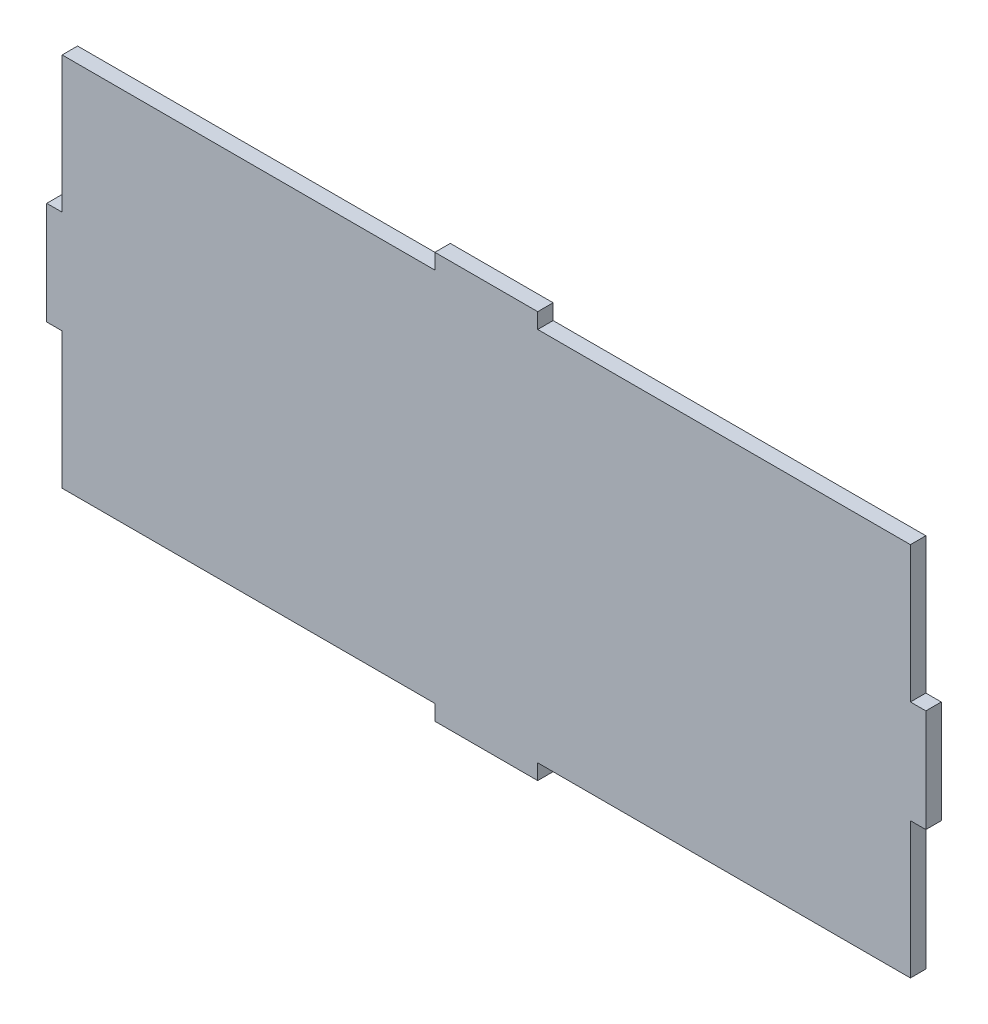
ISO-10303-21;
HEADER;
FILE_DESCRIPTION(('STEP AP214'),'2;1');
FILE_NAME('part.step','',(''),(''),'','','');
FILE_SCHEMA(('AUTOMOTIVE_DESIGN { 1 0 10303 214 1 1 1 1 }'));
ENDSEC;
DATA;
#1=APPLICATION_CONTEXT('core data for automotive mechanical design processes');
#2=APPLICATION_PROTOCOL_DEFINITION('international standard','automotive_design',2000,#1);
#3=PRODUCT_CONTEXT('',#1,'mechanical');
#4=PRODUCT('Part','Part','',(#3));
#5=PRODUCT_RELATED_PRODUCT_CATEGORY('part','',(#4));
#6=PRODUCT_DEFINITION_FORMATION('','',#4);
#7=PRODUCT_DEFINITION_CONTEXT('part definition',#1,'design');
#8=PRODUCT_DEFINITION('design','',#6,#7);
#9=PRODUCT_DEFINITION_SHAPE('','',#8);
#10=(LENGTH_UNIT() NAMED_UNIT(*) SI_UNIT(.MILLI.,.METRE.));
#11=(NAMED_UNIT(*) PLANE_ANGLE_UNIT() SI_UNIT($,.RADIAN.));
#12=(NAMED_UNIT(*) SI_UNIT($,.STERADIAN.) SOLID_ANGLE_UNIT());
#13=UNCERTAINTY_MEASURE_WITH_UNIT(LENGTH_MEASURE(1.E-05),#10,'distance_accuracy_value','');
#14=(GEOMETRIC_REPRESENTATION_CONTEXT(3) GLOBAL_UNCERTAINTY_ASSIGNED_CONTEXT((#13)) GLOBAL_UNIT_ASSIGNED_CONTEXT((#10,
#11,#12)) REPRESENTATION_CONTEXT('',''));
#15=CARTESIAN_POINT('',(0.,0.,0.));
#16=DIRECTION('',(0.,0.,1.));
#17=DIRECTION('',(1.,0.,0.));
#18=AXIS2_PLACEMENT_3D('',#15,#16,#17);
#19=CARTESIAN_POINT('',(-9.99999999999998,0.,3.));
#20=DIRECTION('',(-1.,0.,0.));
#21=DIRECTION('',(0.,0.,1.));
#22=AXIS2_PLACEMENT_3D('',#19,#20,#21);
#23=PLANE('',#22);
#24=DIRECTION('',(0.,1.,0.));
#25=VECTOR('',#24,1.);
#26=CARTESIAN_POINT('',(-9.99999999999998,0.,0.));
#27=LINE('',#26,#25);
#28=CARTESIAN_POINT('',(-9.99999999999998,36.5,0.));
#29=VERTEX_POINT('',#28);
#30=CARTESIAN_POINT('',(-9.99999999999998,39.5,0.));
#31=VERTEX_POINT('',#30);
#32=EDGE_CURVE('E376',#29,#31,#27,.T.);
#33=ORIENTED_EDGE('',*,*,#32,.F.);
#34=DIRECTION('',(0.,0.,-1.));
#35=VECTOR('',#34,1.);
#36=CARTESIAN_POINT('',(-9.99999999999998,36.5,3.));
#37=LINE('',#36,#35);
#38=CARTESIAN_POINT('',(-9.99999999999998,36.5,3.));
#39=VERTEX_POINT('',#38);
#40=EDGE_CURVE('E346',#39,#29,#37,.T.);
#41=ORIENTED_EDGE('',*,*,#40,.F.);
#42=DIRECTION('',(0.,1.,0.));
#43=VECTOR('',#42,1.);
#44=CARTESIAN_POINT('',(-9.99999999999998,0.,3.));
#45=LINE('',#44,#43);
#46=CARTESIAN_POINT('',(-9.99999999999998,39.5,3.));
#47=VERTEX_POINT('',#46);
#48=EDGE_CURVE('E392',#39,#47,#45,.T.);
#49=ORIENTED_EDGE('',*,*,#48,.T.);
#50=DIRECTION('',(0.,0.,-1.));
#51=VECTOR('',#50,1.);
#52=CARTESIAN_POINT('',(-9.99999999999998,39.5,3.));
#53=LINE('',#52,#51);
#54=EDGE_CURVE('E349',#47,#31,#53,.T.);
#55=ORIENTED_EDGE('',*,*,#54,.T.);
#56=EDGE_LOOP('',(#33,#41,#49,#55));
#57=FACE_BOUND('',#56,.T.);
#58=ADVANCED_FACE('F145',(#57),#23,.T.);
#59=CARTESIAN_POINT('',(0.,39.5,3.));
#60=DIRECTION('',(0.,-1.,0.));
#61=DIRECTION('',(0.,0.,-1.));
#62=AXIS2_PLACEMENT_3D('',#59,#60,#61);
#63=PLANE('',#62);
#64=DIRECTION('',(-1.,0.,0.));
#65=VECTOR('',#64,1.);
#66=CARTESIAN_POINT('',(0.,39.5,0.));
#67=LINE('',#66,#65);
#68=CARTESIAN_POINT('',(10.,39.5,0.));
#69=VERTEX_POINT('',#68);
#70=EDGE_CURVE('E361',#69,#31,#67,.T.);
#71=ORIENTED_EDGE('',*,*,#70,.T.);
#72=ORIENTED_EDGE('',*,*,#54,.F.);
#73=DIRECTION('',(-1.,0.,0.));
#74=VECTOR('',#73,1.);
#75=CARTESIAN_POINT('',(0.,39.5,3.));
#76=LINE('',#75,#74);
#77=CARTESIAN_POINT('',(10.,39.5,3.));
#78=VERTEX_POINT('',#77);
#79=EDGE_CURVE('E365',#78,#47,#76,.T.);
#80=ORIENTED_EDGE('',*,*,#79,.F.);
#81=DIRECTION('',(0.,0.,-1.));
#82=VECTOR('',#81,1.);
#83=CARTESIAN_POINT('',(10.,39.5,3.));
#84=LINE('',#83,#82);
#85=EDGE_CURVE('E256',#78,#69,#84,.T.);
#86=ORIENTED_EDGE('',*,*,#85,.T.);
#87=EDGE_LOOP('',(#71,#72,#80,#86));
#88=FACE_BOUND('',#87,.T.);
#89=ADVANCED_FACE('F358',(#88),#63,.F.);
#90=CARTESIAN_POINT('',(10.,0.,3.));
#91=DIRECTION('',(-1.,0.,0.));
#92=DIRECTION('',(0.,0.,1.));
#93=AXIS2_PLACEMENT_3D('',#90,#91,#92);
#94=PLANE('',#93);
#95=DIRECTION('',(0.,1.,0.));
#96=VECTOR('',#95,1.);
#97=CARTESIAN_POINT('',(10.,0.,0.));
#98=LINE('',#97,#96);
#99=CARTESIAN_POINT('',(10.,36.5,0.));
#100=VERTEX_POINT('',#99);
#101=EDGE_CURVE('E373',#100,#69,#98,.T.);
#102=ORIENTED_EDGE('',*,*,#101,.T.);
#103=ORIENTED_EDGE('',*,*,#85,.F.);
#104=DIRECTION('',(0.,1.,0.));
#105=VECTOR('',#104,1.);
#106=CARTESIAN_POINT('',(10.,0.,3.));
#107=LINE('',#106,#105);
#108=CARTESIAN_POINT('',(10.,36.5,3.));
#109=VERTEX_POINT('',#108);
#110=EDGE_CURVE('E397',#109,#78,#107,.T.);
#111=ORIENTED_EDGE('',*,*,#110,.F.);
#112=DIRECTION('',(0.,0.,-1.));
#113=VECTOR('',#112,1.);
#114=CARTESIAN_POINT('',(10.,36.5,3.));
#115=LINE('',#114,#113);
#116=EDGE_CURVE('E248',#109,#100,#115,.T.);
#117=ORIENTED_EDGE('',*,*,#116,.T.);
#118=EDGE_LOOP('',(#102,#103,#111,#117));
#119=FACE_BOUND('',#118,.T.);
#120=ADVANCED_FACE('F419',(#119),#94,.F.);
#121=CARTESIAN_POINT('',(0.,36.5,3.));
#122=DIRECTION('',(0.,1.,0.));
#123=DIRECTION('',(0.,0.,1.));
#124=AXIS2_PLACEMENT_3D('',#121,#122,#123);
#125=PLANE('',#124);
#126=DIRECTION('',(1.,0.,0.));
#127=VECTOR('',#126,1.);
#128=CARTESIAN_POINT('',(0.,36.5,0.));
#129=LINE('',#128,#127);
#130=CARTESIAN_POINT('',(82.5,36.5,0.));
#131=VERTEX_POINT('',#130);
#132=EDGE_CURVE('E379',#100,#131,#129,.T.);
#133=ORIENTED_EDGE('',*,*,#132,.F.);
#134=ORIENTED_EDGE('',*,*,#116,.F.);
#135=DIRECTION('',(1.,0.,0.));
#136=VECTOR('',#135,1.);
#137=CARTESIAN_POINT('',(0.,36.5,3.));
#138=LINE('',#137,#136);
#139=CARTESIAN_POINT('',(82.5,36.5,3.));
#140=VERTEX_POINT('',#139);
#141=EDGE_CURVE('E400',#109,#140,#138,.T.);
#142=ORIENTED_EDGE('',*,*,#141,.T.);
#143=DIRECTION('',(0.,0.,-1.));
#144=VECTOR('',#143,1.);
#145=CARTESIAN_POINT('',(82.5,36.5,3.));
#146=LINE('',#145,#144);
#147=EDGE_CURVE('E244',#140,#131,#146,.T.);
#148=ORIENTED_EDGE('',*,*,#147,.T.);
#149=EDGE_LOOP('',(#133,#134,#142,#148));
#150=FACE_BOUND('',#149,.T.);
#151=ADVANCED_FACE('F417',(#150),#125,.T.);
#152=CARTESIAN_POINT('',(-82.5,36.5,0.));
#153=VERTEX_POINT('',#152);
#154=EDGE_CURVE('E378',#153,#29,#129,.T.);
#155=ORIENTED_EDGE('',*,*,#154,.F.);
#156=DIRECTION('',(0.,0.,-1.));
#157=VECTOR('',#156,1.);
#158=CARTESIAN_POINT('',(-82.5,36.5,3.));
#159=LINE('',#158,#157);
#160=CARTESIAN_POINT('',(-82.5,36.5,3.));
#161=VERTEX_POINT('',#160);
#162=EDGE_CURVE('E343',#161,#153,#159,.T.);
#163=ORIENTED_EDGE('',*,*,#162,.F.);
#164=EDGE_CURVE('E395',#161,#39,#138,.T.);
#165=ORIENTED_EDGE('',*,*,#164,.T.);
#166=ORIENTED_EDGE('',*,*,#40,.T.);
#167=EDGE_LOOP('',(#155,#163,#165,#166));
#168=FACE_BOUND('',#167,.T.);
#169=ADVANCED_FACE('F480',(#168),#125,.T.);
#170=CARTESIAN_POINT('',(-82.5,0.,3.));
#171=DIRECTION('',(1.,0.,0.));
#172=DIRECTION('',(0.,0.,-1.));
#173=AXIS2_PLACEMENT_3D('',#170,#171,#172);
#174=PLANE('',#173);
#175=DIRECTION('',(0.,-1.,0.));
#176=VECTOR('',#175,1.);
#177=CARTESIAN_POINT('',(-82.5,0.,3.));
#178=LINE('',#177,#176);
#179=CARTESIAN_POINT('',(-82.5,-10.,3.));
#180=VERTEX_POINT('',#179);
#181=CARTESIAN_POINT('',(-82.5,-36.5,3.));
#182=VERTEX_POINT('',#181);
#183=EDGE_CURVE('E391',#180,#182,#178,.T.);
#184=ORIENTED_EDGE('',*,*,#183,.F.);
#185=DIRECTION('',(0.,0.,-1.));
#186=VECTOR('',#185,1.);
#187=CARTESIAN_POINT('',(-82.5,-10.,3.));
#188=LINE('',#187,#186);
#189=CARTESIAN_POINT('',(-82.5,-10.,0.));
#190=VERTEX_POINT('',#189);
#191=EDGE_CURVE('E241',#180,#190,#188,.T.);
#192=ORIENTED_EDGE('',*,*,#191,.T.);
#193=DIRECTION('',(0.,-1.,0.));
#194=VECTOR('',#193,1.);
#195=CARTESIAN_POINT('',(-82.5,0.,0.));
#196=LINE('',#195,#194);
#197=CARTESIAN_POINT('',(-82.5,-36.5,0.));
#198=VERTEX_POINT('',#197);
#199=EDGE_CURVE('E473',#190,#198,#196,.T.);
#200=ORIENTED_EDGE('',*,*,#199,.T.);
#201=DIRECTION('',(0.,0.,-1.));
#202=VECTOR('',#201,1.);
#203=CARTESIAN_POINT('',(-82.5,-36.5,3.));
#204=LINE('',#203,#202);
#205=EDGE_CURVE('E329',#182,#198,#204,.T.);
#206=ORIENTED_EDGE('',*,*,#205,.F.);
#207=EDGE_LOOP('',(#184,#192,#200,#206));
#208=FACE_BOUND('',#207,.T.);
#209=ADVANCED_FACE('F472',(#208),#174,.F.);
#210=CARTESIAN_POINT('',(82.5,0.,3.));
#211=DIRECTION('',(1.,0.,0.));
#212=DIRECTION('',(0.,0.,-1.));
#213=AXIS2_PLACEMENT_3D('',#210,#211,#212);
#214=PLANE('',#213);
#215=DIRECTION('',(0.,0.,-1.));
#216=VECTOR('',#215,1.);
#217=CARTESIAN_POINT('',(82.5,-10.,3.));
#218=LINE('',#217,#216);
#219=CARTESIAN_POINT('',(82.5,-10.,3.));
#220=VERTEX_POINT('',#219);
#221=CARTESIAN_POINT('',(82.5,-10.,0.));
#222=VERTEX_POINT('',#221);
#223=EDGE_CURVE('E12',#220,#222,#218,.T.);
#224=ORIENTED_EDGE('',*,*,#223,.F.);
#225=DIRECTION('',(0.,-1.,0.));
#226=VECTOR('',#225,1.);
#227=CARTESIAN_POINT('',(82.5,0.,3.));
#228=LINE('',#227,#226);
#229=CARTESIAN_POINT('',(82.5,-36.5,3.));
#230=VERTEX_POINT('',#229);
#231=EDGE_CURVE('E330',#220,#230,#228,.T.);
#232=ORIENTED_EDGE('',*,*,#231,.T.);
#233=DIRECTION('',(0.,0.,-1.));
#234=VECTOR('',#233,1.);
#235=CARTESIAN_POINT('',(82.5,-36.5,3.));
#236=LINE('',#235,#234);
#237=CARTESIAN_POINT('',(82.5,-36.5,0.));
#238=VERTEX_POINT('',#237);
#239=EDGE_CURVE('E338',#230,#238,#236,.T.);
#240=ORIENTED_EDGE('',*,*,#239,.T.);
#241=DIRECTION('',(0.,-1.,0.));
#242=VECTOR('',#241,1.);
#243=CARTESIAN_POINT('',(82.5,0.,0.));
#244=LINE('',#243,#242);
#245=EDGE_CURVE('E288',#222,#238,#244,.T.);
#246=ORIENTED_EDGE('',*,*,#245,.F.);
#247=EDGE_LOOP('',(#224,#232,#240,#246));
#248=FACE_BOUND('',#247,.T.);
#249=ADVANCED_FACE('F465',(#248),#214,.T.);
#250=CARTESIAN_POINT('',(0.,0.,0.));
#251=DIRECTION('',(0.,0.,1.));
#252=DIRECTION('',(1.,0.,0.));
#253=AXIS2_PLACEMENT_3D('',#250,#251,#252);
#254=PLANE('',#253);
#255=CARTESIAN_POINT('',(82.5,10.,0.));
#256=VERTEX_POINT('',#255);
#257=EDGE_CURVE('E383',#131,#256,#244,.T.);
#258=ORIENTED_EDGE('',*,*,#257,.T.);
#259=DIRECTION('',(1.,0.,0.));
#260=VECTOR('',#259,1.);
#261=CARTESIAN_POINT('',(82.5,10.,0.));
#262=LINE('',#261,#260);
#263=CARTESIAN_POINT('',(85.5,10.,0.));
#264=VERTEX_POINT('',#263);
#265=EDGE_CURVE('E299',#256,#264,#262,.T.);
#266=ORIENTED_EDGE('',*,*,#265,.T.);
#267=DIRECTION('',(0.,-1.,0.));
#268=VECTOR('',#267,1.);
#269=CARTESIAN_POINT('',(85.5,10.,0.));
#270=LINE('',#269,#268);
#271=CARTESIAN_POINT('',(85.5,-10.,0.));
#272=VERTEX_POINT('',#271);
#273=EDGE_CURVE('E302',#264,#272,#270,.T.);
#274=ORIENTED_EDGE('',*,*,#273,.T.);
#275=DIRECTION('',(1.,0.,0.));
#276=VECTOR('',#275,1.);
#277=CARTESIAN_POINT('',(82.5,-10.,0.));
#278=LINE('',#277,#276);
#279=EDGE_CURVE('E293',#222,#272,#278,.T.);
#280=ORIENTED_EDGE('',*,*,#279,.F.);
#281=ORIENTED_EDGE('',*,*,#245,.T.);
#282=DIRECTION('',(1.,0.,0.));
#283=VECTOR('',#282,1.);
#284=CARTESIAN_POINT('',(0.,-36.5,0.));
#285=LINE('',#284,#283);
#286=CARTESIAN_POINT('',(10.,-36.5,0.));
#287=VERTEX_POINT('',#286);
#288=EDGE_CURVE('E230',#287,#238,#285,.T.);
#289=ORIENTED_EDGE('',*,*,#288,.F.);
#290=DIRECTION('',(0.,-1.,0.));
#291=VECTOR('',#290,1.);
#292=CARTESIAN_POINT('',(10.,-36.5,0.));
#293=LINE('',#292,#291);
#294=CARTESIAN_POINT('',(10.,-39.5,0.));
#295=VERTEX_POINT('',#294);
#296=EDGE_CURVE('E216',#287,#295,#293,.T.);
#297=ORIENTED_EDGE('',*,*,#296,.T.);
#298=DIRECTION('',(1.,0.,0.));
#299=VECTOR('',#298,1.);
#300=CARTESIAN_POINT('',(-9.99999999999998,-39.5,0.));
#301=LINE('',#300,#299);
#302=CARTESIAN_POINT('',(-9.99999999999998,-39.5,0.));
#303=VERTEX_POINT('',#302);
#304=EDGE_CURVE('E205',#303,#295,#301,.T.);
#305=ORIENTED_EDGE('',*,*,#304,.F.);
#306=DIRECTION('',(0.,-1.,0.));
#307=VECTOR('',#306,1.);
#308=CARTESIAN_POINT('',(-9.99999999999998,-36.5,0.));
#309=LINE('',#308,#307);
#310=CARTESIAN_POINT('',(-9.99999999999998,-36.5,0.));
#311=VERTEX_POINT('',#310);
#312=EDGE_CURVE('E224',#311,#303,#309,.T.);
#313=ORIENTED_EDGE('',*,*,#312,.F.);
#314=EDGE_CURVE('E320',#198,#311,#285,.T.);
#315=ORIENTED_EDGE('',*,*,#314,.F.);
#316=ORIENTED_EDGE('',*,*,#199,.F.);
#317=DIRECTION('',(-1.,0.,0.));
#318=VECTOR('',#317,1.);
#319=CARTESIAN_POINT('',(-82.5,-10.,0.));
#320=LINE('',#319,#318);
#321=CARTESIAN_POINT('',(-85.5,-10.,0.));
#322=VERTEX_POINT('',#321);
#323=EDGE_CURVE('E264',#190,#322,#320,.T.);
#324=ORIENTED_EDGE('',*,*,#323,.T.);
#325=DIRECTION('',(0.,-1.,0.));
#326=VECTOR('',#325,1.);
#327=CARTESIAN_POINT('',(-85.5,10.,0.));
#328=LINE('',#327,#326);
#329=CARTESIAN_POINT('',(-85.5,10.,0.));
#330=VERTEX_POINT('',#329);
#331=EDGE_CURVE('E273',#330,#322,#328,.T.);
#332=ORIENTED_EDGE('',*,*,#331,.F.);
#333=DIRECTION('',(-1.,0.,0.));
#334=VECTOR('',#333,1.);
#335=CARTESIAN_POINT('',(-82.5,10.,0.));
#336=LINE('',#335,#334);
#337=CARTESIAN_POINT('',(-82.5,10.,0.));
#338=VERTEX_POINT('',#337);
#339=EDGE_CURVE('E270',#338,#330,#336,.T.);
#340=ORIENTED_EDGE('',*,*,#339,.F.);
#341=EDGE_CURVE('E334',#153,#338,#196,.T.);
#342=ORIENTED_EDGE('',*,*,#341,.F.);
#343=ORIENTED_EDGE('',*,*,#154,.T.);
#344=ORIENTED_EDGE('',*,*,#32,.T.);
#345=ORIENTED_EDGE('',*,*,#70,.F.);
#346=ORIENTED_EDGE('',*,*,#101,.F.);
#347=ORIENTED_EDGE('',*,*,#132,.T.);
#348=EDGE_LOOP('',(#258,#266,#274,#280,#281,#289,#297,#305,#313,#315,#316,#324,#332,#340,#342,
#343,#344,#345,#346,#347));
#349=FACE_BOUND('',#348,.T.);
#350=ADVANCED_FACE('F227',(#349),#254,.F.);
#351=CARTESIAN_POINT('',(0.,0.,3.));
#352=DIRECTION('',(0.,0.,1.));
#353=DIRECTION('',(1.,0.,0.));
#354=AXIS2_PLACEMENT_3D('',#351,#352,#353);
#355=PLANE('',#354);
#356=CARTESIAN_POINT('',(82.5,10.,3.));
#357=VERTEX_POINT('',#356);
#358=EDGE_CURVE('E332',#140,#357,#228,.T.);
#359=ORIENTED_EDGE('',*,*,#358,.F.);
#360=ORIENTED_EDGE('',*,*,#141,.F.);
#361=ORIENTED_EDGE('',*,*,#110,.T.);
#362=ORIENTED_EDGE('',*,*,#79,.T.);
#363=ORIENTED_EDGE('',*,*,#48,.F.);
#364=ORIENTED_EDGE('',*,*,#164,.F.);
#365=CARTESIAN_POINT('',(-82.5,10.,3.));
#366=VERTEX_POINT('',#365);
#367=EDGE_CURVE('E388',#161,#366,#178,.T.);
#368=ORIENTED_EDGE('',*,*,#367,.T.);
#369=DIRECTION('',(-1.,0.,0.));
#370=VECTOR('',#369,1.);
#371=CARTESIAN_POINT('',(-82.5,10.,3.));
#372=LINE('',#371,#370);
#373=CARTESIAN_POINT('',(-85.5,10.,3.));
#374=VERTEX_POINT('',#373);
#375=EDGE_CURVE('E260',#366,#374,#372,.T.);
#376=ORIENTED_EDGE('',*,*,#375,.T.);
#377=DIRECTION('',(0.,-1.,0.));
#378=VECTOR('',#377,1.);
#379=CARTESIAN_POINT('',(-85.5,10.,3.));
#380=LINE('',#379,#378);
#381=CARTESIAN_POINT('',(-85.5,-10.,3.));
#382=VERTEX_POINT('',#381);
#383=EDGE_CURVE('E263',#374,#382,#380,.T.);
#384=ORIENTED_EDGE('',*,*,#383,.T.);
#385=DIRECTION('',(-1.,0.,0.));
#386=VECTOR('',#385,1.);
#387=CARTESIAN_POINT('',(-82.5,-10.,3.));
#388=LINE('',#387,#386);
#389=EDGE_CURVE('E266',#180,#382,#388,.T.);
#390=ORIENTED_EDGE('',*,*,#389,.F.);
#391=ORIENTED_EDGE('',*,*,#183,.T.);
#392=DIRECTION('',(1.,0.,0.));
#393=VECTOR('',#392,1.);
#394=CARTESIAN_POINT('',(0.,-36.5,3.));
#395=LINE('',#394,#393);
#396=CARTESIAN_POINT('',(-9.99999999999998,-36.5,3.));
#397=VERTEX_POINT('',#396);
#398=EDGE_CURVE('E341',#182,#397,#395,.T.);
#399=ORIENTED_EDGE('',*,*,#398,.T.);
#400=DIRECTION('',(0.,-1.,0.));
#401=VECTOR('',#400,1.);
#402=CARTESIAN_POINT('',(-9.99999999999998,-36.5,3.));
#403=LINE('',#402,#401);
#404=CARTESIAN_POINT('',(-9.99999999999998,-39.5,3.));
#405=VERTEX_POINT('',#404);
#406=EDGE_CURVE('E231',#397,#405,#403,.T.);
#407=ORIENTED_EDGE('',*,*,#406,.T.);
#408=DIRECTION('',(1.,0.,0.));
#409=VECTOR('',#408,1.);
#410=CARTESIAN_POINT('',(-9.99999999999998,-39.5,3.));
#411=LINE('',#410,#409);
#412=CARTESIAN_POINT('',(10.,-39.5,3.));
#413=VERTEX_POINT('',#412);
#414=EDGE_CURVE('E234',#405,#413,#411,.T.);
#415=ORIENTED_EDGE('',*,*,#414,.T.);
#416=DIRECTION('',(0.,-1.,0.));
#417=VECTOR('',#416,1.);
#418=CARTESIAN_POINT('',(10.,-36.5,3.));
#419=LINE('',#418,#417);
#420=CARTESIAN_POINT('',(10.,-36.5,3.));
#421=VERTEX_POINT('',#420);
#422=EDGE_CURVE('E219',#421,#413,#419,.T.);
#423=ORIENTED_EDGE('',*,*,#422,.F.);
#424=EDGE_CURVE('E387',#421,#230,#395,.T.);
#425=ORIENTED_EDGE('',*,*,#424,.T.);
#426=ORIENTED_EDGE('',*,*,#231,.F.);
#427=DIRECTION('',(1.,0.,0.));
#428=VECTOR('',#427,1.);
#429=CARTESIAN_POINT('',(82.5,-10.,3.));
#430=LINE('',#429,#428);
#431=CARTESIAN_POINT('',(85.5,-10.,3.));
#432=VERTEX_POINT('',#431);
#433=EDGE_CURVE('E296',#220,#432,#430,.T.);
#434=ORIENTED_EDGE('',*,*,#433,.T.);
#435=DIRECTION('',(0.,-1.,0.));
#436=VECTOR('',#435,1.);
#437=CARTESIAN_POINT('',(85.5,10.,3.));
#438=LINE('',#437,#436);
#439=CARTESIAN_POINT('',(85.5,10.,3.));
#440=VERTEX_POINT('',#439);
#441=EDGE_CURVE('E292',#440,#432,#438,.T.);
#442=ORIENTED_EDGE('',*,*,#441,.F.);
#443=DIRECTION('',(1.,0.,0.));
#444=VECTOR('',#443,1.);
#445=CARTESIAN_POINT('',(82.5,10.,3.));
#446=LINE('',#445,#444);
#447=EDGE_CURVE('E289',#357,#440,#446,.T.);
#448=ORIENTED_EDGE('',*,*,#447,.F.);
#449=EDGE_LOOP('',(#359,#360,#361,#362,#363,#364,#368,#376,#384,#390,#391,#399,#407,#415,#423,
#425,#426,#434,#442,#448));
#450=FACE_BOUND('',#449,.T.);
#451=ADVANCED_FACE('F411',(#450),#355,.T.);
#452=CARTESIAN_POINT('',(0.,-36.5,3.));
#453=DIRECTION('',(0.,1.,0.));
#454=DIRECTION('',(0.,0.,1.));
#455=AXIS2_PLACEMENT_3D('',#452,#453,#454);
#456=PLANE('',#455);
#457=ORIENTED_EDGE('',*,*,#424,.F.);
#458=DIRECTION('',(0.,0.,-1.));
#459=VECTOR('',#458,1.);
#460=CARTESIAN_POINT('',(10.,-36.5,3.));
#461=LINE('',#460,#459);
#462=EDGE_CURVE('E242',#421,#287,#461,.T.);
#463=ORIENTED_EDGE('',*,*,#462,.T.);
#464=ORIENTED_EDGE('',*,*,#288,.T.);
#465=ORIENTED_EDGE('',*,*,#239,.F.);
#466=EDGE_LOOP('',(#457,#463,#464,#465));
#467=FACE_BOUND('',#466,.T.);
#468=ADVANCED_FACE('F468',(#467),#456,.F.);
#469=DIRECTION('',(0.,0.,-1.));
#470=VECTOR('',#469,1.);
#471=CARTESIAN_POINT('',(-9.99999999999998,-36.5,3.));
#472=LINE('',#471,#470);
#473=EDGE_CURVE('E238',#397,#311,#472,.T.);
#474=ORIENTED_EDGE('',*,*,#473,.F.);
#475=ORIENTED_EDGE('',*,*,#398,.F.);
#476=ORIENTED_EDGE('',*,*,#205,.T.);
#477=ORIENTED_EDGE('',*,*,#314,.T.);
#478=EDGE_LOOP('',(#474,#475,#476,#477));
#479=FACE_BOUND('',#478,.T.);
#480=ADVANCED_FACE('F325',(#479),#456,.F.);
#481=DIRECTION('',(0.,0.,-1.));
#482=VECTOR('',#481,1.);
#483=CARTESIAN_POINT('',(-82.5,10.,3.));
#484=LINE('',#483,#482);
#485=EDGE_CURVE('E279',#366,#338,#484,.T.);
#486=ORIENTED_EDGE('',*,*,#485,.F.);
#487=ORIENTED_EDGE('',*,*,#367,.F.);
#488=ORIENTED_EDGE('',*,*,#162,.T.);
#489=ORIENTED_EDGE('',*,*,#341,.T.);
#490=EDGE_LOOP('',(#486,#487,#488,#489));
#491=FACE_BOUND('',#490,.T.);
#492=ADVANCED_FACE('F488',(#491),#174,.F.);
#493=ORIENTED_EDGE('',*,*,#358,.T.);
#494=DIRECTION('',(0.,0.,-1.));
#495=VECTOR('',#494,1.);
#496=CARTESIAN_POINT('',(82.5,10.,3.));
#497=LINE('',#496,#495);
#498=EDGE_CURVE('E155',#357,#256,#497,.T.);
#499=ORIENTED_EDGE('',*,*,#498,.T.);
#500=ORIENTED_EDGE('',*,*,#257,.F.);
#501=ORIENTED_EDGE('',*,*,#147,.F.);
#502=EDGE_LOOP('',(#493,#499,#500,#501));
#503=FACE_BOUND('',#502,.T.);
#504=ADVANCED_FACE('F404',(#503),#214,.T.);
#505=CARTESIAN_POINT('',(-9.99999999999998,-39.5,3.));
#506=DIRECTION('',(0.,1.,0.));
#507=DIRECTION('',(0.,0.,1.));
#508=AXIS2_PLACEMENT_3D('',#505,#506,#507);
#509=PLANE('',#508);
#510=ORIENTED_EDGE('',*,*,#304,.T.);
#511=DIRECTION('',(0.,0.,-1.));
#512=VECTOR('',#511,1.);
#513=CARTESIAN_POINT('',(10.,-39.5,3.));
#514=LINE('',#513,#512);
#515=EDGE_CURVE('E212',#413,#295,#514,.T.);
#516=ORIENTED_EDGE('',*,*,#515,.F.);
#517=ORIENTED_EDGE('',*,*,#414,.F.);
#518=DIRECTION('',(0.,0.,-1.));
#519=VECTOR('',#518,1.);
#520=CARTESIAN_POINT('',(-9.99999999999998,-39.5,3.));
#521=LINE('',#520,#519);
#522=EDGE_CURVE('E149',#405,#303,#521,.T.);
#523=ORIENTED_EDGE('',*,*,#522,.T.);
#524=EDGE_LOOP('',(#510,#516,#517,#523));
#525=FACE_BOUND('',#524,.T.);
#526=ADVANCED_FACE('F221',(#525),#509,.F.);
#527=CARTESIAN_POINT('',(10.,-36.5,3.));
#528=DIRECTION('',(1.,0.,0.));
#529=DIRECTION('',(0.,0.,-1.));
#530=AXIS2_PLACEMENT_3D('',#527,#528,#529);
#531=PLANE('',#530);
#532=ORIENTED_EDGE('',*,*,#296,.F.);
#533=ORIENTED_EDGE('',*,*,#462,.F.);
#534=ORIENTED_EDGE('',*,*,#422,.T.);
#535=ORIENTED_EDGE('',*,*,#515,.T.);
#536=EDGE_LOOP('',(#532,#533,#534,#535));
#537=FACE_BOUND('',#536,.T.);
#538=ADVANCED_FACE('F213',(#537),#531,.T.);
#539=CARTESIAN_POINT('',(-9.99999999999998,-36.5,3.));
#540=DIRECTION('',(1.,0.,0.));
#541=DIRECTION('',(0.,0.,-1.));
#542=AXIS2_PLACEMENT_3D('',#539,#540,#541);
#543=PLANE('',#542);
#544=ORIENTED_EDGE('',*,*,#312,.T.);
#545=ORIENTED_EDGE('',*,*,#522,.F.);
#546=ORIENTED_EDGE('',*,*,#406,.F.);
#547=ORIENTED_EDGE('',*,*,#473,.T.);
#548=EDGE_LOOP('',(#544,#545,#546,#547));
#549=FACE_BOUND('',#548,.T.);
#550=ADVANCED_FACE('F147',(#549),#543,.F.);
#551=CARTESIAN_POINT('',(-85.5,10.,3.));
#552=DIRECTION('',(1.,0.,0.));
#553=DIRECTION('',(0.,0.,-1.));
#554=AXIS2_PLACEMENT_3D('',#551,#552,#553);
#555=PLANE('',#554);
#556=ORIENTED_EDGE('',*,*,#331,.T.);
#557=DIRECTION('',(0.,0.,-1.));
#558=VECTOR('',#557,1.);
#559=CARTESIAN_POINT('',(-85.5,-10.,3.));
#560=LINE('',#559,#558);
#561=EDGE_CURVE('E269',#382,#322,#560,.T.);
#562=ORIENTED_EDGE('',*,*,#561,.F.);
#563=ORIENTED_EDGE('',*,*,#383,.F.);
#564=DIRECTION('',(0.,0.,-1.));
#565=VECTOR('',#564,1.);
#566=CARTESIAN_POINT('',(-85.5,10.,3.));
#567=LINE('',#566,#565);
#568=EDGE_CURVE('E285',#374,#330,#567,.T.);
#569=ORIENTED_EDGE('',*,*,#568,.T.);
#570=EDGE_LOOP('',(#556,#562,#563,#569));
#571=FACE_BOUND('',#570,.T.);
#572=ADVANCED_FACE('F492',(#571),#555,.F.);
#573=CARTESIAN_POINT('',(-82.5,-10.,3.));
#574=DIRECTION('',(0.,-1.,0.));
#575=DIRECTION('',(0.,0.,-1.));
#576=AXIS2_PLACEMENT_3D('',#573,#574,#575);
#577=PLANE('',#576);
#578=ORIENTED_EDGE('',*,*,#323,.F.);
#579=ORIENTED_EDGE('',*,*,#191,.F.);
#580=ORIENTED_EDGE('',*,*,#389,.T.);
#581=ORIENTED_EDGE('',*,*,#561,.T.);
#582=EDGE_LOOP('',(#578,#579,#580,#581));
#583=FACE_BOUND('',#582,.T.);
#584=ADVANCED_FACE('F495',(#583),#577,.T.);
#585=CARTESIAN_POINT('',(-82.5,10.,3.));
#586=DIRECTION('',(0.,-1.,0.));
#587=DIRECTION('',(0.,0.,-1.));
#588=AXIS2_PLACEMENT_3D('',#585,#586,#587);
#589=PLANE('',#588);
#590=ORIENTED_EDGE('',*,*,#339,.T.);
#591=ORIENTED_EDGE('',*,*,#568,.F.);
#592=ORIENTED_EDGE('',*,*,#375,.F.);
#593=ORIENTED_EDGE('',*,*,#485,.T.);
#594=EDGE_LOOP('',(#590,#591,#592,#593));
#595=FACE_BOUND('',#594,.T.);
#596=ADVANCED_FACE('F490',(#595),#589,.F.);
#597=CARTESIAN_POINT('',(85.5,10.,3.));
#598=DIRECTION('',(1.,0.,0.));
#599=DIRECTION('',(0.,0.,-1.));
#600=AXIS2_PLACEMENT_3D('',#597,#598,#599);
#601=PLANE('',#600);
#602=ORIENTED_EDGE('',*,*,#273,.F.);
#603=DIRECTION('',(0.,0.,-1.));
#604=VECTOR('',#603,1.);
#605=CARTESIAN_POINT('',(85.5,10.,3.));
#606=LINE('',#605,#604);
#607=EDGE_CURVE('E298',#440,#264,#606,.T.);
#608=ORIENTED_EDGE('',*,*,#607,.F.);
#609=ORIENTED_EDGE('',*,*,#441,.T.);
#610=DIRECTION('',(0.,0.,-1.));
#611=VECTOR('',#610,1.);
#612=CARTESIAN_POINT('',(85.5,-10.,3.));
#613=LINE('',#612,#611);
#614=EDGE_CURVE('E274',#432,#272,#613,.T.);
#615=ORIENTED_EDGE('',*,*,#614,.T.);
#616=EDGE_LOOP('',(#602,#608,#609,#615));
#617=FACE_BOUND('',#616,.T.);
#618=ADVANCED_FACE('F503',(#617),#601,.T.);
#619=CARTESIAN_POINT('',(82.5,10.,3.));
#620=DIRECTION('',(0.,1.,0.));
#621=DIRECTION('',(0.,0.,1.));
#622=AXIS2_PLACEMENT_3D('',#619,#620,#621);
#623=PLANE('',#622);
#624=ORIENTED_EDGE('',*,*,#265,.F.);
#625=ORIENTED_EDGE('',*,*,#498,.F.);
#626=ORIENTED_EDGE('',*,*,#447,.T.);
#627=ORIENTED_EDGE('',*,*,#607,.T.);
#628=EDGE_LOOP('',(#624,#625,#626,#627));
#629=FACE_BOUND('',#628,.T.);
#630=ADVANCED_FACE('F498',(#629),#623,.T.);
#631=CARTESIAN_POINT('',(82.5,-10.,3.));
#632=DIRECTION('',(0.,1.,0.));
#633=DIRECTION('',(0.,0.,1.));
#634=AXIS2_PLACEMENT_3D('',#631,#632,#633);
#635=PLANE('',#634);
#636=ORIENTED_EDGE('',*,*,#279,.T.);
#637=ORIENTED_EDGE('',*,*,#614,.F.);
#638=ORIENTED_EDGE('',*,*,#433,.F.);
#639=ORIENTED_EDGE('',*,*,#223,.T.);
#640=EDGE_LOOP('',(#636,#637,#638,#639));
#641=FACE_BOUND('',#640,.T.);
#642=ADVANCED_FACE('F461',(#641),#635,.F.);
#643=CLOSED_SHELL('',(#58,#89,#120,#151,#169,#209,#249,#350,#451,#468,#480,#492,#504,#526,#538,
#550,#572,#584,#596,#618,#630,#642));
#644=MANIFOLD_SOLID_BREP('B2',#643);
#645=ADVANCED_BREP_SHAPE_REPRESENTATION('',(#18,#644),#14);
#646=SHAPE_DEFINITION_REPRESENTATION(#9,#645);
ENDSEC;
END-ISO-10303-21;
